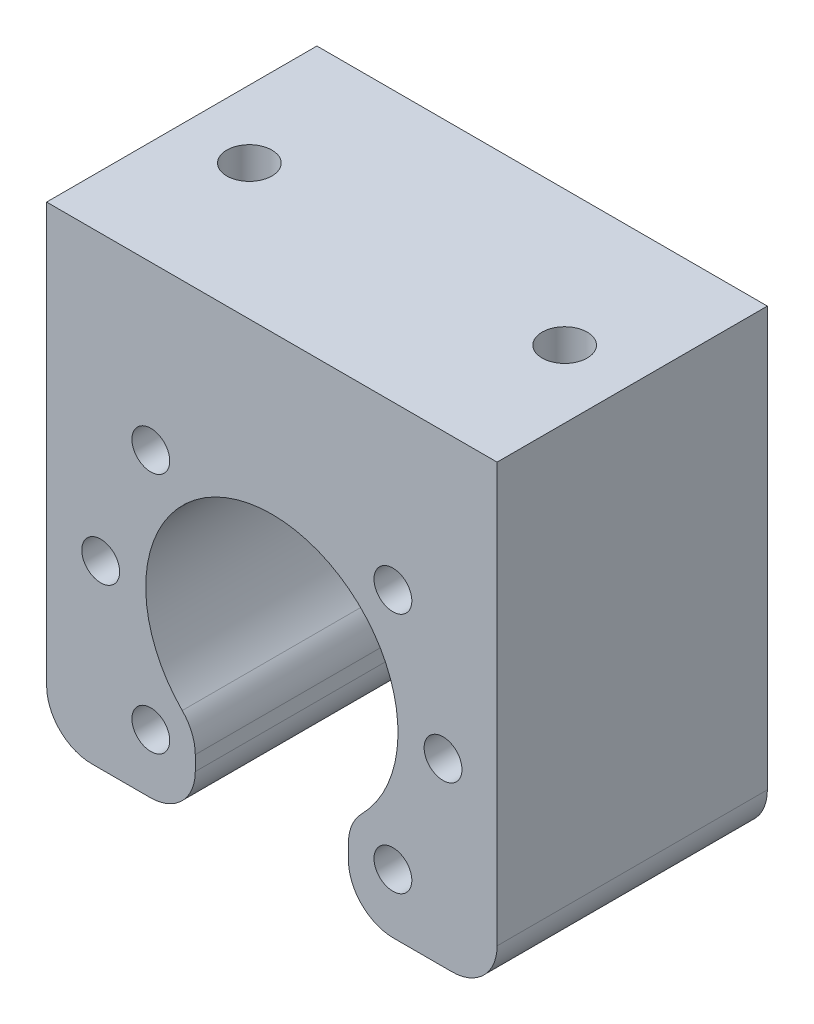
ISO-10303-21;
HEADER;
FILE_DESCRIPTION(('STEP AP214'),'2;1');
FILE_NAME('part.step','',(''),(''),'','','');
FILE_SCHEMA(('AUTOMOTIVE_DESIGN { 1 0 10303 214 1 1 1 1 }'));
ENDSEC;
DATA;
#1=APPLICATION_CONTEXT('core data for automotive mechanical design processes');
#2=APPLICATION_PROTOCOL_DEFINITION('international standard','automotive_design',2000,#1);
#3=PRODUCT_CONTEXT('',#1,'mechanical');
#4=PRODUCT('Part','Part','',(#3));
#5=PRODUCT_RELATED_PRODUCT_CATEGORY('part','',(#4));
#6=PRODUCT_DEFINITION_FORMATION('','',#4);
#7=PRODUCT_DEFINITION_CONTEXT('part definition',#1,'design');
#8=PRODUCT_DEFINITION('design','',#6,#7);
#9=PRODUCT_DEFINITION_SHAPE('','',#8);
#10=(LENGTH_UNIT() NAMED_UNIT(*) SI_UNIT(.MILLI.,.METRE.));
#11=(NAMED_UNIT(*) PLANE_ANGLE_UNIT() SI_UNIT($,.RADIAN.));
#12=(NAMED_UNIT(*) SI_UNIT($,.STERADIAN.) SOLID_ANGLE_UNIT());
#13=UNCERTAINTY_MEASURE_WITH_UNIT(LENGTH_MEASURE(1.E-05),#10,'distance_accuracy_value','');
#14=(GEOMETRIC_REPRESENTATION_CONTEXT(3) GLOBAL_UNCERTAINTY_ASSIGNED_CONTEXT((#13)) GLOBAL_UNIT_ASSIGNED_CONTEXT((#10,
#11,#12)) REPRESENTATION_CONTEXT('',''));
#15=CARTESIAN_POINT('',(0.,0.,0.));
#16=DIRECTION('',(0.,0.,1.));
#17=DIRECTION('',(1.,0.,0.));
#18=AXIS2_PLACEMENT_3D('',#15,#16,#17);
#19=CARTESIAN_POINT('',(-8.5,-11.1242977306435,30.));
#20=DIRECTION('',(-1.,0.,0.));
#21=DIRECTION('',(0.,-1.,0.));
#22=AXIS2_PLACEMENT_3D('',#19,#20,#21);
#23=PLANE('',#22);
#24=DIRECTION('',(0.,1.,0.));
#25=VECTOR('',#24,1.);
#26=CARTESIAN_POINT('',(-8.5,-11.1242977306435,30.));
#27=LINE('',#26,#25);
#28=CARTESIAN_POINT('',(-8.5,-15.,30.));
#29=VERTEX_POINT('',#28);
#30=CARTESIAN_POINT('',(-8.5,-13.3697419571209,30.));
#31=VERTEX_POINT('',#30);
#32=EDGE_CURVE('E213',#29,#31,#27,.T.);
#33=ORIENTED_EDGE('',*,*,#32,.F.);
#34=DIRECTION('',(0.,0.,-1.));
#35=VECTOR('',#34,1.);
#36=CARTESIAN_POINT('',(-8.5,-15.,30.));
#37=LINE('',#36,#35);
#38=CARTESIAN_POINT('',(-8.5,-15.,0.));
#39=VERTEX_POINT('',#38);
#40=EDGE_CURVE('E299',#29,#39,#37,.T.);
#41=ORIENTED_EDGE('',*,*,#40,.T.);
#42=DIRECTION('',(0.,1.,0.));
#43=VECTOR('',#42,1.);
#44=CARTESIAN_POINT('',(-8.5,-11.1242977306435,0.));
#45=LINE('',#44,#43);
#46=CARTESIAN_POINT('',(-8.5,-13.3697419571209,0.));
#47=VERTEX_POINT('',#46);
#48=EDGE_CURVE('E212',#39,#47,#45,.T.);
#49=ORIENTED_EDGE('',*,*,#48,.T.);
#50=DIRECTION('',(0.,0.,-1.));
#51=VECTOR('',#50,1.);
#52=CARTESIAN_POINT('',(-8.5,-13.3697419571209,30.));
#53=LINE('',#52,#51);
#54=EDGE_CURVE('E297',#47,#31,#53,.F.);
#55=ORIENTED_EDGE('',*,*,#54,.T.);
#56=EDGE_LOOP('',(#33,#41,#49,#55));
#57=FACE_BOUND('',#56,.T.);
#58=ADVANCED_FACE('F41',(#57),#23,.F.);
#59=CARTESIAN_POINT('',(0.,0.,30.));
#60=DIRECTION('',(0.,0.,-1.));
#61=DIRECTION('',(-1.,0.,0.));
#62=AXIS2_PLACEMENT_3D('',#59,#60,#61);
#63=CYLINDRICAL_SURFACE('',#62,14.);
#64=CARTESIAN_POINT('',(0.,0.,0.));
#65=DIRECTION('',(0.,0.,-1.));
#66=DIRECTION('',(1.,0.,0.));
#67=AXIS2_PLACEMENT_3D('',#64,#65,#66);
#68=CIRCLE('',#67,14.);
#69=CARTESIAN_POINT('',(-9.94736842105263,-9.85138881051016,0.));
#70=VERTEX_POINT('',#69);
#71=CARTESIAN_POINT('',(9.94736842105263,-9.85138881051016,0.));
#72=VERTEX_POINT('',#71);
#73=EDGE_CURVE('E238',#70,#72,#68,.T.);
#74=ORIENTED_EDGE('',*,*,#73,.T.);
#75=DIRECTION('',(0.,0.,-1.));
#76=VECTOR('',#75,1.);
#77=CARTESIAN_POINT('',(9.94736842105263,-9.85138881051016,30.));
#78=LINE('',#77,#76);
#79=CARTESIAN_POINT('',(9.94736842105263,-9.85138881051016,30.));
#80=VERTEX_POINT('',#79);
#81=EDGE_CURVE('E11',#72,#80,#78,.F.);
#82=ORIENTED_EDGE('',*,*,#81,.T.);
#83=CARTESIAN_POINT('',(0.,0.,30.));
#84=DIRECTION('',(0.,0.,-1.));
#85=DIRECTION('',(1.,0.,0.));
#86=AXIS2_PLACEMENT_3D('',#83,#84,#85);
#87=CIRCLE('',#86,14.);
#88=CARTESIAN_POINT('',(-9.94736842105263,-9.85138881051016,30.));
#89=VERTEX_POINT('',#88);
#90=EDGE_CURVE('E216',#89,#80,#87,.T.);
#91=ORIENTED_EDGE('',*,*,#90,.F.);
#92=DIRECTION('',(0.,0.,-1.));
#93=VECTOR('',#92,1.);
#94=CARTESIAN_POINT('',(-9.94736842105263,-9.85138881051016,30.));
#95=LINE('',#94,#93);
#96=EDGE_CURVE('E55',#89,#70,#95,.T.);
#97=ORIENTED_EDGE('',*,*,#96,.T.);
#98=EDGE_LOOP('',(#74,#82,#91,#97));
#99=FACE_BOUND('',#98,.T.);
#100=ADVANCED_FACE('F330',(#99),#63,.F.);
#101=CARTESIAN_POINT('',(8.5,-11.1242977306435,30.));
#102=DIRECTION('',(1.,0.,0.));
#103=DIRECTION('',(0.,1.,0.));
#104=AXIS2_PLACEMENT_3D('',#101,#102,#103);
#105=PLANE('',#104);
#106=DIRECTION('',(0.,-1.,0.));
#107=VECTOR('',#106,1.);
#108=CARTESIAN_POINT('',(8.5,-11.1242977306435,0.));
#109=LINE('',#108,#107);
#110=CARTESIAN_POINT('',(8.5,-13.3697419571209,0.));
#111=VERTEX_POINT('',#110);
#112=CARTESIAN_POINT('',(8.5,-15.,0.));
#113=VERTEX_POINT('',#112);
#114=EDGE_CURVE('E241',#111,#113,#109,.T.);
#115=ORIENTED_EDGE('',*,*,#114,.T.);
#116=DIRECTION('',(0.,0.,-1.));
#117=VECTOR('',#116,1.);
#118=CARTESIAN_POINT('',(8.5,-15.,30.));
#119=LINE('',#118,#117);
#120=CARTESIAN_POINT('',(8.5,-15.,30.));
#121=VERTEX_POINT('',#120);
#122=EDGE_CURVE('E305',#113,#121,#119,.F.);
#123=ORIENTED_EDGE('',*,*,#122,.T.);
#124=DIRECTION('',(0.,-1.,0.));
#125=VECTOR('',#124,1.);
#126=CARTESIAN_POINT('',(8.5,-11.1242977306435,30.));
#127=LINE('',#126,#125);
#128=CARTESIAN_POINT('',(8.5,-13.3697419571209,30.));
#129=VERTEX_POINT('',#128);
#130=EDGE_CURVE('E220',#129,#121,#127,.T.);
#131=ORIENTED_EDGE('',*,*,#130,.F.);
#132=DIRECTION('',(0.,0.,-1.));
#133=VECTOR('',#132,1.);
#134=CARTESIAN_POINT('',(8.5,-13.3697419571209,30.));
#135=LINE('',#134,#133);
#136=EDGE_CURVE('E302',#129,#111,#135,.T.);
#137=ORIENTED_EDGE('',*,*,#136,.T.);
#138=EDGE_LOOP('',(#115,#123,#131,#137));
#139=FACE_BOUND('',#138,.T.);
#140=ADVANCED_FACE('F336',(#139),#105,.F.);
#141=CARTESIAN_POINT('',(8.5,-20.,30.));
#142=DIRECTION('',(0.,1.,0.));
#143=DIRECTION('',(-1.,0.,0.));
#144=AXIS2_PLACEMENT_3D('',#141,#142,#143);
#145=PLANE('',#144);
#146=DIRECTION('',(1.,0.,0.));
#147=VECTOR('',#146,1.);
#148=CARTESIAN_POINT('',(8.5,-20.,0.));
#149=LINE('',#148,#147);
#150=CARTESIAN_POINT('',(13.5,-20.,0.));
#151=VERTEX_POINT('',#150);
#152=CARTESIAN_POINT('',(20.,-20.,0.));
#153=VERTEX_POINT('',#152);
#154=EDGE_CURVE('E244',#151,#153,#149,.T.);
#155=ORIENTED_EDGE('',*,*,#154,.T.);
#156=DIRECTION('',(0.,0.,-1.));
#157=VECTOR('',#156,1.);
#158=CARTESIAN_POINT('',(20.,-20.,30.));
#159=LINE('',#158,#157);
#160=CARTESIAN_POINT('',(20.,-20.,30.));
#161=VERTEX_POINT('',#160);
#162=EDGE_CURVE('E71',#153,#161,#159,.F.);
#163=ORIENTED_EDGE('',*,*,#162,.T.);
#164=DIRECTION('',(1.,0.,0.));
#165=VECTOR('',#164,1.);
#166=CARTESIAN_POINT('',(8.5,-20.,30.));
#167=LINE('',#166,#165);
#168=CARTESIAN_POINT('',(13.5,-20.,30.));
#169=VERTEX_POINT('',#168);
#170=EDGE_CURVE('E223',#169,#161,#167,.T.);
#171=ORIENTED_EDGE('',*,*,#170,.F.);
#172=DIRECTION('',(0.,0.,-1.));
#173=VECTOR('',#172,1.);
#174=CARTESIAN_POINT('',(13.5,-20.,30.));
#175=LINE('',#174,#173);
#176=EDGE_CURVE('E293',#169,#151,#175,.T.);
#177=ORIENTED_EDGE('',*,*,#176,.T.);
#178=EDGE_LOOP('',(#155,#163,#171,#177));
#179=FACE_BOUND('',#178,.T.);
#180=ADVANCED_FACE('F377',(#179),#145,.F.);
#181=CARTESIAN_POINT('',(25.,31.5,30.));
#182=DIRECTION('',(-1.,0.,0.));
#183=DIRECTION('',(0.,-1.,0.));
#184=AXIS2_PLACEMENT_3D('',#181,#182,#183);
#185=PLANE('',#184);
#186=DIRECTION('',(0.,1.,0.));
#187=VECTOR('',#186,1.);
#188=CARTESIAN_POINT('',(25.,31.5,30.));
#189=LINE('',#188,#187);
#190=CARTESIAN_POINT('',(25.,-15.,30.));
#191=VERTEX_POINT('',#190);
#192=CARTESIAN_POINT('',(25.,31.5,30.));
#193=VERTEX_POINT('',#192);
#194=EDGE_CURVE('E225',#191,#193,#189,.T.);
#195=ORIENTED_EDGE('',*,*,#194,.F.);
#196=DIRECTION('',(0.,0.,-1.));
#197=VECTOR('',#196,1.);
#198=CARTESIAN_POINT('',(25.,-15.,30.));
#199=LINE('',#198,#197);
#200=CARTESIAN_POINT('',(25.,-15.,0.));
#201=VERTEX_POINT('',#200);
#202=EDGE_CURVE('E290',#191,#201,#199,.T.);
#203=ORIENTED_EDGE('',*,*,#202,.T.);
#204=DIRECTION('',(0.,1.,0.));
#205=VECTOR('',#204,1.);
#206=CARTESIAN_POINT('',(25.,31.5,0.));
#207=LINE('',#206,#205);
#208=CARTESIAN_POINT('',(25.,31.5,0.));
#209=VERTEX_POINT('',#208);
#210=EDGE_CURVE('E246',#201,#209,#207,.T.);
#211=ORIENTED_EDGE('',*,*,#210,.T.);
#212=DIRECTION('',(0.,0.,-1.));
#213=VECTOR('',#212,1.);
#214=CARTESIAN_POINT('',(25.,31.5,30.));
#215=LINE('',#214,#213);
#216=EDGE_CURVE('E257',#193,#209,#215,.T.);
#217=ORIENTED_EDGE('',*,*,#216,.F.);
#218=EDGE_LOOP('',(#195,#203,#211,#217));
#219=FACE_BOUND('',#218,.T.);
#220=ADVANCED_FACE('F385',(#219),#185,.F.);
#221=CARTESIAN_POINT('',(-25.,31.5,30.));
#222=DIRECTION('',(0.,-1.,0.));
#223=DIRECTION('',(0.,0.,-1.));
#224=AXIS2_PLACEMENT_3D('',#221,#222,#223);
#225=PLANE('',#224);
#226=CARTESIAN_POINT('',(-17.4999999999991,31.5,14.9999999999994));
#227=DIRECTION('',(0.,1.,0.));
#228=DIRECTION('',(0.,0.,1.));
#229=AXIS2_PLACEMENT_3D('',#226,#227,#228);
#230=CIRCLE('',#229,2.49999999999999);
#231=CARTESIAN_POINT('',(-17.4999999999991,31.5,17.4999999999994));
#232=VERTEX_POINT('',#231);
#233=EDGE_CURVE('E163',#232,#232,#230,.T.);
#234=ORIENTED_EDGE('',*,*,#233,.F.);
#235=EDGE_LOOP('',(#234));
#236=FACE_BOUND('',#235,.T.);
#237=CARTESIAN_POINT('',(17.5000000000009,31.5,14.9999999999995));
#238=DIRECTION('',(0.,1.,0.));
#239=DIRECTION('',(0.,0.,1.));
#240=AXIS2_PLACEMENT_3D('',#237,#238,#239);
#241=CIRCLE('',#240,2.49999999999999);
#242=CARTESIAN_POINT('',(17.5000000000009,31.5,17.4999999999995));
#243=VERTEX_POINT('',#242);
#244=EDGE_CURVE('E166',#243,#243,#241,.T.);
#245=ORIENTED_EDGE('',*,*,#244,.F.);
#246=EDGE_LOOP('',(#245));
#247=FACE_BOUND('',#246,.T.);
#248=DIRECTION('',(-1.,0.,0.));
#249=VECTOR('',#248,1.);
#250=CARTESIAN_POINT('',(-25.,31.5,0.));
#251=LINE('',#250,#249);
#252=CARTESIAN_POINT('',(-25.,31.5,0.));
#253=VERTEX_POINT('',#252);
#254=EDGE_CURVE('E248',#209,#253,#251,.T.);
#255=ORIENTED_EDGE('',*,*,#254,.T.);
#256=DIRECTION('',(0.,0.,-1.));
#257=VECTOR('',#256,1.);
#258=CARTESIAN_POINT('',(-25.,31.5,30.));
#259=LINE('',#258,#257);
#260=CARTESIAN_POINT('',(-25.,31.5,30.));
#261=VERTEX_POINT('',#260);
#262=EDGE_CURVE('E235',#261,#253,#259,.T.);
#263=ORIENTED_EDGE('',*,*,#262,.F.);
#264=DIRECTION('',(-1.,0.,0.));
#265=VECTOR('',#264,1.);
#266=CARTESIAN_POINT('',(-25.,31.5,30.));
#267=LINE('',#266,#265);
#268=EDGE_CURVE('E227',#193,#261,#267,.T.);
#269=ORIENTED_EDGE('',*,*,#268,.F.);
#270=ORIENTED_EDGE('',*,*,#216,.T.);
#271=EDGE_LOOP('',(#255,#263,#269,#270));
#272=FACE_BOUND('',#271,.T.);
#273=ADVANCED_FACE('F392',(#236,#247,#272),#225,.F.);
#274=CARTESIAN_POINT('',(-25.,31.5,30.));
#275=DIRECTION('',(1.,0.,0.));
#276=DIRECTION('',(0.,1.,0.));
#277=AXIS2_PLACEMENT_3D('',#274,#275,#276);
#278=PLANE('',#277);
#279=DIRECTION('',(0.,-1.,0.));
#280=VECTOR('',#279,1.);
#281=CARTESIAN_POINT('',(-25.,31.5,0.));
#282=LINE('',#281,#280);
#283=CARTESIAN_POINT('',(-25.,-15.,0.));
#284=VERTEX_POINT('',#283);
#285=EDGE_CURVE('E250',#253,#284,#282,.T.);
#286=ORIENTED_EDGE('',*,*,#285,.T.);
#287=DIRECTION('',(0.,0.,-1.));
#288=VECTOR('',#287,1.);
#289=CARTESIAN_POINT('',(-25.,-15.,30.));
#290=LINE('',#289,#288);
#291=CARTESIAN_POINT('',(-25.,-15.,30.));
#292=VERTEX_POINT('',#291);
#293=EDGE_CURVE('E277',#284,#292,#290,.F.);
#294=ORIENTED_EDGE('',*,*,#293,.T.);
#295=DIRECTION('',(0.,-1.,0.));
#296=VECTOR('',#295,1.);
#297=CARTESIAN_POINT('',(-25.,31.5,30.));
#298=LINE('',#297,#296);
#299=EDGE_CURVE('E229',#261,#292,#298,.T.);
#300=ORIENTED_EDGE('',*,*,#299,.F.);
#301=ORIENTED_EDGE('',*,*,#262,.T.);
#302=EDGE_LOOP('',(#286,#294,#300,#301));
#303=FACE_BOUND('',#302,.T.);
#304=ADVANCED_FACE('F395',(#303),#278,.F.);
#305=CARTESIAN_POINT('',(-25.,-20.,30.));
#306=DIRECTION('',(0.,1.,0.));
#307=DIRECTION('',(-1.,0.,0.));
#308=AXIS2_PLACEMENT_3D('',#305,#306,#307);
#309=PLANE('',#308);
#310=DIRECTION('',(1.,0.,0.));
#311=VECTOR('',#310,1.);
#312=CARTESIAN_POINT('',(-25.,-20.,30.));
#313=LINE('',#312,#311);
#314=CARTESIAN_POINT('',(-20.,-20.,30.));
#315=VERTEX_POINT('',#314);
#316=CARTESIAN_POINT('',(-13.5,-20.,30.));
#317=VERTEX_POINT('',#316);
#318=EDGE_CURVE('E232',#315,#317,#313,.T.);
#319=ORIENTED_EDGE('',*,*,#318,.F.);
#320=DIRECTION('',(0.,0.,-1.));
#321=VECTOR('',#320,1.);
#322=CARTESIAN_POINT('',(-20.,-20.,30.));
#323=LINE('',#322,#321);
#324=CARTESIAN_POINT('',(-20.,-20.,0.));
#325=VERTEX_POINT('',#324);
#326=EDGE_CURVE('E262',#315,#325,#323,.T.);
#327=ORIENTED_EDGE('',*,*,#326,.T.);
#328=DIRECTION('',(1.,0.,0.));
#329=VECTOR('',#328,1.);
#330=CARTESIAN_POINT('',(-25.,-20.,0.));
#331=LINE('',#330,#329);
#332=CARTESIAN_POINT('',(-13.5,-20.,0.));
#333=VERTEX_POINT('',#332);
#334=EDGE_CURVE('E217',#325,#333,#331,.T.);
#335=ORIENTED_EDGE('',*,*,#334,.T.);
#336=DIRECTION('',(0.,0.,-1.));
#337=VECTOR('',#336,1.);
#338=CARTESIAN_POINT('',(-13.5,-20.,30.));
#339=LINE('',#338,#337);
#340=EDGE_CURVE('E260',#333,#317,#339,.F.);
#341=ORIENTED_EDGE('',*,*,#340,.T.);
#342=EDGE_LOOP('',(#319,#327,#335,#341));
#343=FACE_BOUND('',#342,.T.);
#344=ADVANCED_FACE('F401',(#343),#309,.F.);
#345=CARTESIAN_POINT('',(0.,0.,30.));
#346=DIRECTION('',(0.,0.,1.));
#347=DIRECTION('',(1.,0.,0.));
#348=AXIS2_PLACEMENT_3D('',#345,#346,#347);
#349=PLANE('',#348);
#350=CARTESIAN_POINT('',(13.4350288425458,13.4350288425462,30.));
#351=DIRECTION('',(0.,0.,-1.));
#352=DIRECTION('',(-1.,0.,0.));
#353=AXIS2_PLACEMENT_3D('',#350,#351,#352);
#354=CIRCLE('',#353,2.09999999999999);
#355=CARTESIAN_POINT('',(11.3350288425458,13.4350288425462,30.));
#356=VERTEX_POINT('',#355);
#357=EDGE_CURVE('E179',#356,#356,#354,.T.);
#358=ORIENTED_EDGE('',*,*,#357,.T.);
#359=EDGE_LOOP('',(#358));
#360=FACE_BOUND('',#359,.T.);
#361=CARTESIAN_POINT('',(-13.4350288425429,13.4350288425463,30.));
#362=DIRECTION('',(0.,0.,-1.));
#363=DIRECTION('',(-1.,0.,0.));
#364=AXIS2_PLACEMENT_3D('',#361,#362,#363);
#365=CIRCLE('',#364,2.09999999999999);
#366=CARTESIAN_POINT('',(-15.5350288425429,13.4350288425463,30.));
#367=VERTEX_POINT('',#366);
#368=EDGE_CURVE('E185',#367,#367,#365,.T.);
#369=ORIENTED_EDGE('',*,*,#368,.T.);
#370=EDGE_LOOP('',(#369));
#371=FACE_BOUND('',#370,.T.);
#372=CARTESIAN_POINT('',(-18.9999999999986,1.84111669868261E-12,30.));
#373=DIRECTION('',(0.,0.,-1.));
#374=DIRECTION('',(-1.,0.,0.));
#375=AXIS2_PLACEMENT_3D('',#372,#373,#374);
#376=CIRCLE('',#375,2.09999999999999);
#377=CARTESIAN_POINT('',(-21.0999999999986,1.84111669868261E-12,30.));
#378=VERTEX_POINT('',#377);
#379=EDGE_CURVE('E191',#378,#378,#376,.T.);
#380=ORIENTED_EDGE('',*,*,#379,.T.);
#381=EDGE_LOOP('',(#380));
#382=FACE_BOUND('',#381,.T.);
#383=CARTESIAN_POINT('',(-13.435028842543,-13.4350288425426,30.));
#384=DIRECTION('',(0.,0.,-1.));
#385=DIRECTION('',(-1.,0.,0.));
#386=AXIS2_PLACEMENT_3D('',#383,#384,#385);
#387=CIRCLE('',#386,2.09999999999999);
#388=CARTESIAN_POINT('',(-15.535028842543,-13.4350288425426,30.));
#389=VERTEX_POINT('',#388);
#390=EDGE_CURVE('E197',#389,#389,#387,.T.);
#391=ORIENTED_EDGE('',*,*,#390,.T.);
#392=EDGE_LOOP('',(#391));
#393=FACE_BOUND('',#392,.T.);
#394=CARTESIAN_POINT('',(13.4350288425457,-13.4350288425427,30.));
#395=DIRECTION('',(0.,0.,-1.));
#396=DIRECTION('',(-1.,0.,0.));
#397=AXIS2_PLACEMENT_3D('',#394,#395,#396);
#398=CIRCLE('',#397,2.09999999999999);
#399=CARTESIAN_POINT('',(11.3350288425457,-13.4350288425427,30.));
#400=VERTEX_POINT('',#399);
#401=EDGE_CURVE('E203',#400,#400,#398,.T.);
#402=ORIENTED_EDGE('',*,*,#401,.T.);
#403=EDGE_LOOP('',(#402));
#404=FACE_BOUND('',#403,.T.);
#405=CARTESIAN_POINT('',(19.0000000000014,1.7113408654584E-12,30.));
#406=DIRECTION('',(0.,0.,-1.));
#407=DIRECTION('',(-1.,0.,0.));
#408=AXIS2_PLACEMENT_3D('',#405,#406,#407);
#409=CIRCLE('',#408,2.09999999999999);
#410=CARTESIAN_POINT('',(16.9000000000014,1.7113408654584E-12,30.));
#411=VERTEX_POINT('',#410);
#412=EDGE_CURVE('E209',#411,#411,#409,.T.);
#413=ORIENTED_EDGE('',*,*,#412,.T.);
#414=EDGE_LOOP('',(#413));
#415=FACE_BOUND('',#414,.T.);
#416=ORIENTED_EDGE('',*,*,#299,.T.);
#417=CARTESIAN_POINT('',(-20.,-15.,30.));
#418=DIRECTION('',(0.,0.,1.));
#419=DIRECTION('',(1.,0.,0.));
#420=AXIS2_PLACEMENT_3D('',#417,#418,#419);
#421=CIRCLE('',#420,5.);
#422=EDGE_CURVE('E288',#292,#315,#421,.T.);
#423=ORIENTED_EDGE('',*,*,#422,.T.);
#424=ORIENTED_EDGE('',*,*,#318,.T.);
#425=CARTESIAN_POINT('',(-13.5,-15.,30.));
#426=DIRECTION('',(0.,0.,1.));
#427=DIRECTION('',(1.,0.,0.));
#428=AXIS2_PLACEMENT_3D('',#425,#426,#427);
#429=CIRCLE('',#428,5.);
#430=EDGE_CURVE('E285',#317,#29,#429,.T.);
#431=ORIENTED_EDGE('',*,*,#430,.T.);
#432=ORIENTED_EDGE('',*,*,#32,.T.);
#433=CARTESIAN_POINT('',(-13.5,-13.3697419571209,30.));
#434=DIRECTION('',(0.,0.,1.));
#435=DIRECTION('',(1.,0.,0.));
#436=AXIS2_PLACEMENT_3D('',#433,#434,#435);
#437=CIRCLE('',#436,5.);
#438=EDGE_CURVE('E279',#31,#89,#437,.T.);
#439=ORIENTED_EDGE('',*,*,#438,.T.);
#440=ORIENTED_EDGE('',*,*,#90,.T.);
#441=CARTESIAN_POINT('',(13.5,-13.3697419571209,30.));
#442=DIRECTION('',(0.,0.,1.));
#443=DIRECTION('',(1.,0.,0.));
#444=AXIS2_PLACEMENT_3D('',#441,#442,#443);
#445=CIRCLE('',#444,5.);
#446=EDGE_CURVE('E281',#80,#129,#445,.T.);
#447=ORIENTED_EDGE('',*,*,#446,.T.);
#448=ORIENTED_EDGE('',*,*,#130,.T.);
#449=CARTESIAN_POINT('',(13.5,-15.,30.));
#450=DIRECTION('',(0.,0.,1.));
#451=DIRECTION('',(1.,0.,0.));
#452=AXIS2_PLACEMENT_3D('',#449,#450,#451);
#453=CIRCLE('',#452,5.);
#454=EDGE_CURVE('E283',#121,#169,#453,.T.);
#455=ORIENTED_EDGE('',*,*,#454,.T.);
#456=ORIENTED_EDGE('',*,*,#170,.T.);
#457=CARTESIAN_POINT('',(20.,-15.,30.));
#458=DIRECTION('',(0.,0.,1.));
#459=DIRECTION('',(1.,0.,0.));
#460=AXIS2_PLACEMENT_3D('',#457,#458,#459);
#461=CIRCLE('',#460,5.);
#462=EDGE_CURVE('E63',#161,#191,#461,.T.);
#463=ORIENTED_EDGE('',*,*,#462,.T.);
#464=ORIENTED_EDGE('',*,*,#194,.T.);
#465=ORIENTED_EDGE('',*,*,#268,.T.);
#466=EDGE_LOOP('',(#416,#423,#424,#431,#432,#439,#440,#447,#448,#455,#456,#463,#464,#465));
#467=FACE_BOUND('',#466,.T.);
#468=ADVANCED_FACE('F370',(#360,#371,#382,#393,#404,#415,#467),#349,.T.);
#469=CARTESIAN_POINT('',(0.,0.,0.));
#470=DIRECTION('',(0.,0.,1.));
#471=DIRECTION('',(1.,0.,0.));
#472=AXIS2_PLACEMENT_3D('',#469,#470,#471);
#473=PLANE('',#472);
#474=CARTESIAN_POINT('',(13.4350288425458,13.4350288425462,0.));
#475=DIRECTION('',(0.,0.,-1.));
#476=DIRECTION('',(-1.,0.,0.));
#477=AXIS2_PLACEMENT_3D('',#474,#475,#476);
#478=CIRCLE('',#477,2.1);
#479=CARTESIAN_POINT('',(11.3350288425458,13.4350288425462,0.));
#480=VERTEX_POINT('',#479);
#481=EDGE_CURVE('E176',#480,#480,#478,.T.);
#482=ORIENTED_EDGE('',*,*,#481,.F.);
#483=EDGE_LOOP('',(#482));
#484=FACE_BOUND('',#483,.T.);
#485=CARTESIAN_POINT('',(-13.4350288425429,13.4350288425463,0.));
#486=DIRECTION('',(0.,0.,-1.));
#487=DIRECTION('',(-1.,0.,0.));
#488=AXIS2_PLACEMENT_3D('',#485,#486,#487);
#489=CIRCLE('',#488,2.1);
#490=CARTESIAN_POINT('',(-15.5350288425429,13.4350288425463,0.));
#491=VERTEX_POINT('',#490);
#492=EDGE_CURVE('E182',#491,#491,#489,.T.);
#493=ORIENTED_EDGE('',*,*,#492,.F.);
#494=EDGE_LOOP('',(#493));
#495=FACE_BOUND('',#494,.T.);
#496=CARTESIAN_POINT('',(-18.9999999999986,1.84111669868261E-12,0.));
#497=DIRECTION('',(0.,0.,-1.));
#498=DIRECTION('',(-1.,0.,0.));
#499=AXIS2_PLACEMENT_3D('',#496,#497,#498);
#500=CIRCLE('',#499,2.1);
#501=CARTESIAN_POINT('',(-21.0999999999986,1.84111669868261E-12,0.));
#502=VERTEX_POINT('',#501);
#503=EDGE_CURVE('E188',#502,#502,#500,.T.);
#504=ORIENTED_EDGE('',*,*,#503,.F.);
#505=EDGE_LOOP('',(#504));
#506=FACE_BOUND('',#505,.T.);
#507=CARTESIAN_POINT('',(-13.435028842543,-13.4350288425426,0.));
#508=DIRECTION('',(0.,0.,-1.));
#509=DIRECTION('',(-1.,0.,0.));
#510=AXIS2_PLACEMENT_3D('',#507,#508,#509);
#511=CIRCLE('',#510,2.1);
#512=CARTESIAN_POINT('',(-15.535028842543,-13.4350288425426,0.));
#513=VERTEX_POINT('',#512);
#514=EDGE_CURVE('E194',#513,#513,#511,.T.);
#515=ORIENTED_EDGE('',*,*,#514,.F.);
#516=EDGE_LOOP('',(#515));
#517=FACE_BOUND('',#516,.T.);
#518=CARTESIAN_POINT('',(13.4350288425457,-13.4350288425427,0.));
#519=DIRECTION('',(0.,0.,-1.));
#520=DIRECTION('',(-1.,0.,0.));
#521=AXIS2_PLACEMENT_3D('',#518,#519,#520);
#522=CIRCLE('',#521,2.1);
#523=CARTESIAN_POINT('',(11.3350288425457,-13.4350288425427,0.));
#524=VERTEX_POINT('',#523);
#525=EDGE_CURVE('E200',#524,#524,#522,.T.);
#526=ORIENTED_EDGE('',*,*,#525,.F.);
#527=EDGE_LOOP('',(#526));
#528=FACE_BOUND('',#527,.T.);
#529=CARTESIAN_POINT('',(19.0000000000014,1.7113408654584E-12,0.));
#530=DIRECTION('',(0.,0.,-1.));
#531=DIRECTION('',(-1.,0.,0.));
#532=AXIS2_PLACEMENT_3D('',#529,#530,#531);
#533=CIRCLE('',#532,2.1);
#534=CARTESIAN_POINT('',(16.9000000000014,1.7113408654584E-12,0.));
#535=VERTEX_POINT('',#534);
#536=EDGE_CURVE('E206',#535,#535,#533,.T.);
#537=ORIENTED_EDGE('',*,*,#536,.F.);
#538=EDGE_LOOP('',(#537));
#539=FACE_BOUND('',#538,.T.);
#540=ORIENTED_EDGE('',*,*,#334,.F.);
#541=CARTESIAN_POINT('',(-20.,-15.,0.));
#542=DIRECTION('',(0.,0.,1.));
#543=DIRECTION('',(1.,0.,0.));
#544=AXIS2_PLACEMENT_3D('',#541,#542,#543);
#545=CIRCLE('',#544,5.);
#546=EDGE_CURVE('E275',#325,#284,#545,.F.);
#547=ORIENTED_EDGE('',*,*,#546,.T.);
#548=ORIENTED_EDGE('',*,*,#285,.F.);
#549=ORIENTED_EDGE('',*,*,#254,.F.);
#550=ORIENTED_EDGE('',*,*,#210,.F.);
#551=CARTESIAN_POINT('',(20.,-15.,0.));
#552=DIRECTION('',(0.,0.,1.));
#553=DIRECTION('',(1.,0.,0.));
#554=AXIS2_PLACEMENT_3D('',#551,#552,#553);
#555=CIRCLE('',#554,5.);
#556=EDGE_CURVE('E273',#201,#153,#555,.F.);
#557=ORIENTED_EDGE('',*,*,#556,.T.);
#558=ORIENTED_EDGE('',*,*,#154,.F.);
#559=CARTESIAN_POINT('',(13.5,-15.,0.));
#560=DIRECTION('',(0.,0.,1.));
#561=DIRECTION('',(1.,0.,0.));
#562=AXIS2_PLACEMENT_3D('',#559,#560,#561);
#563=CIRCLE('',#562,5.);
#564=EDGE_CURVE('E269',#151,#113,#563,.F.);
#565=ORIENTED_EDGE('',*,*,#564,.T.);
#566=ORIENTED_EDGE('',*,*,#114,.F.);
#567=CARTESIAN_POINT('',(13.5,-13.3697419571209,0.));
#568=DIRECTION('',(0.,0.,1.));
#569=DIRECTION('',(1.,0.,0.));
#570=AXIS2_PLACEMENT_3D('',#567,#568,#569);
#571=CIRCLE('',#570,5.);
#572=EDGE_CURVE('E267',#111,#72,#571,.F.);
#573=ORIENTED_EDGE('',*,*,#572,.T.);
#574=ORIENTED_EDGE('',*,*,#73,.F.);
#575=CARTESIAN_POINT('',(-13.5,-13.3697419571209,0.));
#576=DIRECTION('',(0.,0.,1.));
#577=DIRECTION('',(1.,0.,0.));
#578=AXIS2_PLACEMENT_3D('',#575,#576,#577);
#579=CIRCLE('',#578,5.);
#580=EDGE_CURVE('E265',#70,#47,#579,.F.);
#581=ORIENTED_EDGE('',*,*,#580,.T.);
#582=ORIENTED_EDGE('',*,*,#48,.F.);
#583=CARTESIAN_POINT('',(-13.5,-15.,0.));
#584=DIRECTION('',(0.,0.,1.));
#585=DIRECTION('',(1.,0.,0.));
#586=AXIS2_PLACEMENT_3D('',#583,#584,#585);
#587=CIRCLE('',#586,5.);
#588=EDGE_CURVE('E271',#39,#333,#587,.F.);
#589=ORIENTED_EDGE('',*,*,#588,.T.);
#590=EDGE_LOOP('',(#540,#547,#548,#549,#550,#557,#558,#565,#566,#573,#574,#581,#582,#589));
#591=FACE_BOUND('',#590,.T.);
#592=ADVANCED_FACE('F346',(#484,#495,#506,#517,#528,#539,#591),#473,.F.);
#593=CARTESIAN_POINT('',(-20.,-15.,30.));
#594=DIRECTION('',(0.,0.,-1.));
#595=DIRECTION('',(-1.,0.,0.));
#596=AXIS2_PLACEMENT_3D('',#593,#594,#595);
#597=CYLINDRICAL_SURFACE('',#596,5.);
#598=ORIENTED_EDGE('',*,*,#422,.F.);
#599=ORIENTED_EDGE('',*,*,#293,.F.);
#600=ORIENTED_EDGE('',*,*,#546,.F.);
#601=ORIENTED_EDGE('',*,*,#326,.F.);
#602=EDGE_LOOP('',(#598,#599,#600,#601));
#603=FACE_BOUND('',#602,.T.);
#604=ADVANCED_FACE('F342',(#603),#597,.T.);
#605=CARTESIAN_POINT('',(20.,-15.,30.));
#606=DIRECTION('',(0.,0.,-1.));
#607=DIRECTION('',(-1.,0.,0.));
#608=AXIS2_PLACEMENT_3D('',#605,#606,#607);
#609=CYLINDRICAL_SURFACE('',#608,5.);
#610=ORIENTED_EDGE('',*,*,#462,.F.);
#611=ORIENTED_EDGE('',*,*,#162,.F.);
#612=ORIENTED_EDGE('',*,*,#556,.F.);
#613=ORIENTED_EDGE('',*,*,#202,.F.);
#614=EDGE_LOOP('',(#610,#611,#612,#613));
#615=FACE_BOUND('',#614,.T.);
#616=ADVANCED_FACE('F345',(#615),#609,.T.);
#617=CARTESIAN_POINT('',(-13.5,-15.,30.));
#618=DIRECTION('',(0.,0.,-1.));
#619=DIRECTION('',(-1.,0.,0.));
#620=AXIS2_PLACEMENT_3D('',#617,#618,#619);
#621=CYLINDRICAL_SURFACE('',#620,5.);
#622=ORIENTED_EDGE('',*,*,#430,.F.);
#623=ORIENTED_EDGE('',*,*,#340,.F.);
#624=ORIENTED_EDGE('',*,*,#588,.F.);
#625=ORIENTED_EDGE('',*,*,#40,.F.);
#626=EDGE_LOOP('',(#622,#623,#624,#625));
#627=FACE_BOUND('',#626,.T.);
#628=ADVANCED_FACE('F350',(#627),#621,.T.);
#629=CARTESIAN_POINT('',(13.5,-15.,30.));
#630=DIRECTION('',(0.,0.,-1.));
#631=DIRECTION('',(-1.,0.,0.));
#632=AXIS2_PLACEMENT_3D('',#629,#630,#631);
#633=CYLINDRICAL_SURFACE('',#632,5.);
#634=ORIENTED_EDGE('',*,*,#454,.F.);
#635=ORIENTED_EDGE('',*,*,#122,.F.);
#636=ORIENTED_EDGE('',*,*,#564,.F.);
#637=ORIENTED_EDGE('',*,*,#176,.F.);
#638=EDGE_LOOP('',(#634,#635,#636,#637));
#639=FACE_BOUND('',#638,.T.);
#640=ADVANCED_FACE('F354',(#639),#633,.T.);
#641=CARTESIAN_POINT('',(13.5,-13.3697419571209,30.));
#642=DIRECTION('',(0.,0.,-1.));
#643=DIRECTION('',(-1.,0.,0.));
#644=AXIS2_PLACEMENT_3D('',#641,#642,#643);
#645=CYLINDRICAL_SURFACE('',#644,5.);
#646=ORIENTED_EDGE('',*,*,#446,.F.);
#647=ORIENTED_EDGE('',*,*,#81,.F.);
#648=ORIENTED_EDGE('',*,*,#572,.F.);
#649=ORIENTED_EDGE('',*,*,#136,.F.);
#650=EDGE_LOOP('',(#646,#647,#648,#649));
#651=FACE_BOUND('',#650,.T.);
#652=ADVANCED_FACE('F357',(#651),#645,.T.);
#653=CARTESIAN_POINT('',(-13.5,-13.3697419571209,30.));
#654=DIRECTION('',(0.,0.,-1.));
#655=DIRECTION('',(-1.,0.,0.));
#656=AXIS2_PLACEMENT_3D('',#653,#654,#655);
#657=CYLINDRICAL_SURFACE('',#656,5.);
#658=ORIENTED_EDGE('',*,*,#438,.F.);
#659=ORIENTED_EDGE('',*,*,#54,.F.);
#660=ORIENTED_EDGE('',*,*,#580,.F.);
#661=ORIENTED_EDGE('',*,*,#96,.F.);
#662=EDGE_LOOP('',(#658,#659,#660,#661));
#663=FACE_BOUND('',#662,.T.);
#664=ADVANCED_FACE('F43',(#663),#657,.T.);
#665=CARTESIAN_POINT('',(19.0000000000014,1.7113408654584E-12,0.));
#666=DIRECTION('',(0.,0.,-1.));
#667=DIRECTION('',(-1.,0.,0.));
#668=AXIS2_PLACEMENT_3D('',#665,#666,#667);
#669=CYLINDRICAL_SURFACE('',#668,2.1);
#670=ORIENTED_EDGE('',*,*,#412,.F.);
#671=EDGE_LOOP('',(#670));
#672=FACE_BOUND('',#671,.T.);
#673=ORIENTED_EDGE('',*,*,#536,.T.);
#674=EDGE_LOOP('',(#673));
#675=FACE_BOUND('',#674,.T.);
#676=ADVANCED_FACE('F364',(#672,#675),#669,.F.);
#677=CARTESIAN_POINT('',(13.4350288425457,-13.4350288425427,0.));
#678=DIRECTION('',(0.,0.,-1.));
#679=DIRECTION('',(-1.,0.,0.));
#680=AXIS2_PLACEMENT_3D('',#677,#678,#679);
#681=CYLINDRICAL_SURFACE('',#680,2.1);
#682=ORIENTED_EDGE('',*,*,#401,.F.);
#683=EDGE_LOOP('',(#682));
#684=FACE_BOUND('',#683,.T.);
#685=ORIENTED_EDGE('',*,*,#525,.T.);
#686=EDGE_LOOP('',(#685));
#687=FACE_BOUND('',#686,.T.);
#688=ADVANCED_FACE('F514',(#684,#687),#681,.F.);
#689=CARTESIAN_POINT('',(-13.435028842543,-13.4350288425426,0.));
#690=DIRECTION('',(0.,0.,-1.));
#691=DIRECTION('',(-1.,0.,0.));
#692=AXIS2_PLACEMENT_3D('',#689,#690,#691);
#693=CYLINDRICAL_SURFACE('',#692,2.1);
#694=ORIENTED_EDGE('',*,*,#390,.F.);
#695=EDGE_LOOP('',(#694));
#696=FACE_BOUND('',#695,.T.);
#697=ORIENTED_EDGE('',*,*,#514,.T.);
#698=EDGE_LOOP('',(#697));
#699=FACE_BOUND('',#698,.T.);
#700=ADVANCED_FACE('F525',(#696,#699),#693,.F.);
#701=CARTESIAN_POINT('',(-18.9999999999986,1.84111669868261E-12,0.));
#702=DIRECTION('',(0.,0.,-1.));
#703=DIRECTION('',(-1.,0.,0.));
#704=AXIS2_PLACEMENT_3D('',#701,#702,#703);
#705=CYLINDRICAL_SURFACE('',#704,2.1);
#706=ORIENTED_EDGE('',*,*,#379,.F.);
#707=EDGE_LOOP('',(#706));
#708=FACE_BOUND('',#707,.T.);
#709=ORIENTED_EDGE('',*,*,#503,.T.);
#710=EDGE_LOOP('',(#709));
#711=FACE_BOUND('',#710,.T.);
#712=ADVANCED_FACE('F536',(#708,#711),#705,.F.);
#713=CARTESIAN_POINT('',(-13.4350288425429,13.4350288425463,0.));
#714=DIRECTION('',(0.,0.,-1.));
#715=DIRECTION('',(-1.,0.,0.));
#716=AXIS2_PLACEMENT_3D('',#713,#714,#715);
#717=CYLINDRICAL_SURFACE('',#716,2.1);
#718=CARTESIAN_POINT('',(-15.5350288425429,13.4350288425463,16.5456029083706));
#719=CARTESIAN_POINT('',(-15.5350211289829,13.5088402991268,16.5456007243016));
#720=CARTESIAN_POINT('',(-15.5311030470407,13.5827387728171,16.5406526632039));
#721=CARTESIAN_POINT('',(-15.5157179380661,13.7285086982992,16.5207809288947));
#722=CARTESIAN_POINT('',(-15.5042335637786,13.8003750953179,16.5058343308035));
#723=CARTESIAN_POINT('',(-15.4747057192673,13.9397929412851,16.4658774175586));
#724=CARTESIAN_POINT('',(-15.4566669041198,14.0073474127039,16.4408742434134));
#725=CARTESIAN_POINT('',(-15.41567308627,14.1361843969468,16.3809023024896));
#726=CARTESIAN_POINT('',(-15.3927217414591,14.1974715265567,16.3459409442477));
#727=CARTESIAN_POINT('',(-15.344404563906,14.3114213969755,16.2670857660948));
#728=CARTESIAN_POINT('',(-15.3190791422808,14.364197581287,16.2233306746445));
#729=CARTESIAN_POINT('',(-15.268014639986,14.4612737827105,16.1274689151349));
#730=CARTESIAN_POINT('',(-15.242275466059,14.5055718590234,16.0753603398103));
#731=CARTESIAN_POINT('',(-15.1916173518137,14.5868905797867,15.9619590061694));
#732=CARTESIAN_POINT('',(-15.1667667656512,14.6235706467379,15.9003924599852));
#733=CARTESIAN_POINT('',(-15.1209670810655,14.6876936395224,15.7712976146859));
#734=CARTESIAN_POINT('',(-15.100019624224,14.7151326826572,15.7037668246446));
#735=CARTESIAN_POINT('',(-15.0617733682493,14.7634662590936,15.5578977101825));
#736=CARTESIAN_POINT('',(-15.0449996973658,14.7835076887799,15.4791394578938));
#737=CARTESIAN_POINT('',(-15.0190425685753,14.8139044829089,15.3185580162725));
#738=CARTESIAN_POINT('',(-15.0098629418183,14.8242549586696,15.2367333016595));
#739=CARTESIAN_POINT('',(-14.9991839810832,14.8362773261249,15.0640133091675));
#740=CARTESIAN_POINT('',(-14.9985057137839,14.8370216335478,14.9730007631182));
#741=CARTESIAN_POINT('',(-15.0070202732263,14.8274659638124,14.7919900079227));
#742=CARTESIAN_POINT('',(-15.0162169089166,14.8171617250098,14.7019922037179));
#743=CARTESIAN_POINT('',(-15.0442124233567,14.7844759599291,14.5229932617078));
#744=CARTESIAN_POINT('',(-15.0632780013445,14.761757961048,14.4340939709091));
#745=CARTESIAN_POINT('',(-15.1094525574064,14.7029773363298,14.2630362124722));
#746=CARTESIAN_POINT('',(-15.1365568623472,14.6669224605843,14.1808738637886));
#747=CARTESIAN_POINT('',(-15.1939509253486,14.5833239545368,14.03142660184));
#748=CARTESIAN_POINT('',(-15.2239223990638,14.5366714957981,13.9635238702528));
#749=CARTESIAN_POINT('',(-15.2849133637509,14.4308356275271,13.8388765787188));
#750=CARTESIAN_POINT('',(-15.3159318779604,14.3716636397365,13.7821219386088));
#751=CARTESIAN_POINT('',(-15.3718752986861,14.2490652598762,13.687062236283));
#752=CARTESIAN_POINT('',(-15.3970958268272,14.1868069157965,13.6474200134327));
#753=CARTESIAN_POINT('',(-15.442660016778,14.0549273103147,13.5790680329954));
#754=CARTESIAN_POINT('',(-15.4630044173129,13.9853071665194,13.5503566190205));
#755=CARTESIAN_POINT('',(-15.4957795614943,13.8451334387696,13.5053989306839));
#756=CARTESIAN_POINT('',(-15.5086035072441,13.7748725165094,13.488521906031));
#757=CARTESIAN_POINT('',(-15.5270350052326,13.6317821967281,13.4645389743468));
#758=CARTESIAN_POINT('',(-15.5326427220918,13.558952857838,13.4574328444162));
#759=CARTESIAN_POINT('',(-15.536176319166,13.4131006469521,13.4529367134709));
#760=CARTESIAN_POINT('',(-15.5341324449741,13.3400796747084,13.4555084574801));
#761=CARTESIAN_POINT('',(-15.5225954254717,13.1956237683583,13.4703079248456));
#762=CARTESIAN_POINT('',(-15.5131027194996,13.1241887409672,13.4825350787181));
#763=CARTESIAN_POINT('',(-15.4874330315071,12.9848492636236,13.5167507208906));
#764=CARTESIAN_POINT('',(-15.4712477509417,12.9169493151421,13.538751330441));
#765=CARTESIAN_POINT('',(-15.4335990862969,12.7867137123754,13.5924997129669));
#766=CARTESIAN_POINT('',(-15.4121366506028,12.7243770610215,13.6242457347976));
#767=CARTESIAN_POINT('',(-15.3659260948417,12.6070135237137,13.697089324243));
#768=CARTESIAN_POINT('',(-15.3411853391313,12.551970791446,13.7381660750307));
#769=CARTESIAN_POINT('',(-15.2906237221949,12.4501397357152,13.82895334383));
#770=CARTESIAN_POINT('',(-15.2648027515372,12.4033522510714,13.8786647381942));
#771=CARTESIAN_POINT('',(-15.2135580348055,12.3172517026009,13.9871418400898));
#772=CARTESIAN_POINT('',(-15.1881692394145,12.2782038966718,14.0461337960847));
#773=CARTESIAN_POINT('',(-15.1407005066892,12.2092881236477,14.1704587474741));
#774=CARTESIAN_POINT('',(-15.1186219242268,12.1794239101736,14.2357943213858));
#775=CARTESIAN_POINT('',(-15.0776410961341,12.126190932334,14.377069081426));
#776=CARTESIAN_POINT('',(-15.0591842063012,12.1036164819519,14.4534360450102));
#777=CARTESIAN_POINT('',(-15.0293699747542,12.0680564446212,14.6097075199976));
#778=CARTESIAN_POINT('',(-15.0180161579833,12.0550756179878,14.6896137667636));
#779=CARTESIAN_POINT('',(-15.0023733040656,12.0373189448604,14.8592279394687));
#780=CARTESIAN_POINT('',(-14.9989092028229,12.0334990967409,14.949113694183));
#781=CARTESIAN_POINT('',(-15.0016944222767,12.0366153530939,15.1285773166237));
#782=CARTESIAN_POINT('',(-15.0079480254407,12.0435561996632,15.2181550311634));
#783=CARTESIAN_POINT('',(-15.0301935668008,12.0691032189925,15.39826505945));
#784=CARTESIAN_POINT('',(-15.0465768165374,12.0881790722034,15.4886841565223));
#785=CARTESIAN_POINT('',(-15.0880263861887,12.1393906623842,15.6636673601305));
#786=CARTESIAN_POINT('',(-15.1130893356074,12.1715213307536,15.7482337241243));
#787=CARTESIAN_POINT('',(-15.1678679471733,12.2478688115537,15.9042354899764));
#788=CARTESIAN_POINT('',(-15.1972765361739,12.2913758726481,15.9761234454451));
#789=CARTESIAN_POINT('',(-15.2582843498992,12.3914079725578,16.109079935246));
#790=CARTESIAN_POINT('',(-15.2898811393202,12.4479186969844,16.1701602367769));
#791=CARTESIAN_POINT('',(-15.347903162606,12.5662577662197,16.2734264175898));
#792=CARTESIAN_POINT('',(-15.3745164031485,12.626832099891,16.3169470362928));
#793=CARTESIAN_POINT('',(-15.4234803704345,12.7561833837402,16.3928811671285));
#794=CARTESIAN_POINT('',(-15.4458297023238,12.8249630061996,16.4252910473542));
#795=CARTESIAN_POINT('',(-15.4826003198902,12.9635966525438,16.4768327212876));
#796=CARTESIAN_POINT('',(-15.4974585847607,13.0330569802833,16.4967197673933));
#797=CARTESIAN_POINT('',(-15.520108646677,13.1750606259429,16.5265614303539));
#798=CARTESIAN_POINT('',(-15.5279171070136,13.2475962474053,16.5365394742649));
#799=CARTESIAN_POINT('',(-15.5339893404564,13.3586476096274,16.5442802965297));
#800=CARTESIAN_POINT('',(-15.5350328348163,13.3968265712694,16.5456040387695));
#801=CARTESIAN_POINT('',(-15.5350288425429,13.4350288425463,16.5456029083706));
#802=B_SPLINE_CURVE_WITH_KNOTS('',3,(#718,#719,#720,#721,#722,#723,#724,#725,#726,#727,#728,
#729,#730,#731,#732,#733,#734,#735,#736,#737,#738,#739,#740,#741,#742,#743,#744,#745,#746,#747,
#748,#749,#750,#751,#752,#753,#754,#755,#756,#757,#758,#759,#760,#761,#762,#763,#764,#765,#766,
#767,#768,#769,#770,#771,#772,#773,#774,#775,#776,#777,#778,#779,#780,#781,#782,#783,#784,#785,
#786,#787,#788,#789,#790,#791,#792,#793,#794,#795,#796,#797,#798,#799,#800,#801),.UNSPECIFIED.,
.T.,.F.,(4,2,2,2,2,2,2,2,2,2,2,2,2,2,2,2,2,2,2,2,2,2,2,2,2,2,2,2,2,2,2,2,2,2,2,2,2,2,2,2,2,4),
(0.,0.221316973126152,0.443143134219419,0.664812057525034,0.886316495818798,1.10456778844646,
1.32286898331353,1.54946703183461,1.7761601691155,2.02407460058534,2.27211402726953,
2.54394314939486,2.81587715915431,3.09557642473459,3.37511341107132,3.63661767085682,
3.89788437749896,4.13065328626368,4.36338690860229,4.58251079540642,4.80162968334687,
5.01988334337668,5.23812413159237,5.45663634568449,5.67510931846527,5.89309958428425,
6.11111198744936,6.33564177794379,6.56026321916588,6.80448754067194,7.04883296403781,
7.3177416158547,7.58676880587521,7.86690054710436,8.14692362948801,8.41248740443862,
8.67776023441824,8.91407342963058,9.15046379802283,9.3707207843214,9.59045578613569,
9.70500183951593),.UNSPECIFIED.);
#803=CARTESIAN_POINT('',(-15.5350288425429,13.4350288425463,16.5456029083706));
#804=VERTEX_POINT('',#803);
#805=EDGE_CURVE('E45',#804,#804,#802,.T.);
#806=ORIENTED_EDGE('',*,*,#805,.T.);
#807=EDGE_LOOP('',(#806));
#808=FACE_BOUND('',#807,.T.);
#809=ORIENTED_EDGE('',*,*,#368,.F.);
#810=EDGE_LOOP('',(#809));
#811=FACE_BOUND('',#810,.T.);
#812=ORIENTED_EDGE('',*,*,#492,.T.);
#813=EDGE_LOOP('',(#812));
#814=FACE_BOUND('',#813,.T.);
#815=ADVANCED_FACE('F548',(#808,#811,#814),#717,.F.);
#816=CARTESIAN_POINT('',(13.4350288425458,13.4350288425462,0.));
#817=DIRECTION('',(0.,0.,-1.));
#818=DIRECTION('',(-1.,0.,0.));
#819=AXIS2_PLACEMENT_3D('',#816,#817,#818);
#820=CYLINDRICAL_SURFACE('',#819,2.1);
#821=CARTESIAN_POINT('',(15.5350288425458,13.4350288425462,16.545602908372));
#822=CARTESIAN_POINT('',(15.5350211289858,13.3612173859656,16.5456007243031));
#823=CARTESIAN_POINT('',(15.5311030470435,13.2873189122752,16.5406526632053));
#824=CARTESIAN_POINT('',(15.5157179380689,13.141548986793,16.5207809288962));
#825=CARTESIAN_POINT('',(15.5042335637815,13.0696825897743,16.505834330805));
#826=CARTESIAN_POINT('',(15.4747057192701,12.930264743807,16.4658774175601));
#827=CARTESIAN_POINT('',(15.4566669041225,12.8627102723881,16.4408742434148));
#828=CARTESIAN_POINT('',(15.4156730862727,12.7338732881451,16.3809023024911));
#829=CARTESIAN_POINT('',(15.3927217414618,12.6725861585351,16.3459409442492));
#830=CARTESIAN_POINT('',(15.3444045639086,12.5586362881163,16.2670857660963));
#831=CARTESIAN_POINT('',(15.3190791422833,12.5058601038048,16.2233306746459));
#832=CARTESIAN_POINT('',(15.2680146399884,12.4087839023812,16.1274689151363));
#833=CARTESIAN_POINT('',(15.2422754660614,12.3644858260682,16.0753603398116));
#834=CARTESIAN_POINT('',(15.191617351816,12.2831671053048,15.9619590061707));
#835=CARTESIAN_POINT('',(15.1667667656535,12.2464870383536,15.9003924599864));
#836=CARTESIAN_POINT('',(15.1209670810677,12.182364045569,15.7712976146871));
#837=CARTESIAN_POINT('',(15.1000196242261,12.1549250024342,15.7037668246458));
#838=CARTESIAN_POINT('',(15.0617733682514,12.1065914259978,15.5578977101836));
#839=CARTESIAN_POINT('',(15.0449996973678,12.0865499963115,15.4791394578948));
#840=CARTESIAN_POINT('',(15.0190425685772,12.0561532021824,15.3185580162734));
#841=CARTESIAN_POINT('',(15.0098629418202,12.0458027264217,15.2367333016604));
#842=CARTESIAN_POINT('',(14.999183981085,12.0337803589664,15.0640133091683));
#843=CARTESIAN_POINT('',(14.9985057137857,12.0330360515434,14.9730007631189));
#844=CARTESIAN_POINT('',(15.007020273228,12.0425917212788,14.7919900079233));
#845=CARTESIAN_POINT('',(15.0162169089184,12.0528959600814,14.7019922037184));
#846=CARTESIAN_POINT('',(15.0442124233585,12.0855817251621,14.5229932617081));
#847=CARTESIAN_POINT('',(15.0632780013463,12.1082997240431,14.4340939709094));
#848=CARTESIAN_POINT('',(15.1094525574082,12.1670803487613,14.2630362124723));
#849=CARTESIAN_POINT('',(15.136556862349,12.2031352245067,14.1808738637886));
#850=CARTESIAN_POINT('',(15.1939509253506,12.2867337305542,14.0314266018398));
#851=CARTESIAN_POINT('',(15.2239223990658,12.3333861892929,13.9635238702525));
#852=CARTESIAN_POINT('',(15.284913363753,12.4392220575639,13.8388765787184));
#853=CARTESIAN_POINT('',(15.3159318779626,12.4983940453545,13.7821219386082));
#854=CARTESIAN_POINT('',(15.3718752986884,12.6209924252148,13.6870622362824));
#855=CARTESIAN_POINT('',(15.3970958268296,12.6832507692946,13.647420013432));
#856=CARTESIAN_POINT('',(15.4426600167804,12.8151303747764,13.5790680329945));
#857=CARTESIAN_POINT('',(15.4630044173154,12.8847505185718,13.5503566190196));
#858=CARTESIAN_POINT('',(15.4957795614969,13.0249242463217,13.5053989306829));
#859=CARTESIAN_POINT('',(15.5086035072468,13.0951851685819,13.48852190603));
#860=CARTESIAN_POINT('',(15.5270350052354,13.2382754883633,13.4645389743457));
#861=CARTESIAN_POINT('',(15.5326427220946,13.3111048272534,13.457432844415));
#862=CARTESIAN_POINT('',(15.5361763191689,13.4569570381394,13.4529367134697));
#863=CARTESIAN_POINT('',(15.534132444977,13.5299780103832,13.4555084574788));
#864=CARTESIAN_POINT('',(15.5225954254747,13.6744339167334,13.4703079248442));
#865=CARTESIAN_POINT('',(15.5131027195025,13.7458689441247,13.4825350787167));
#866=CARTESIAN_POINT('',(15.48743303151,13.8852084214684,13.5167507208892));
#867=CARTESIAN_POINT('',(15.4712477509446,13.95310836995,13.5387513304395));
#868=CARTESIAN_POINT('',(15.4335990862998,14.0833439727168,13.5924997129653));
#869=CARTESIAN_POINT('',(15.4121366506057,14.1456806240708,13.624245734796));
#870=CARTESIAN_POINT('',(15.3659260948446,14.2630441613787,13.6970893242414));
#871=CARTESIAN_POINT('',(15.3411853391341,14.3180868936465,13.7381660750291));
#872=CARTESIAN_POINT('',(15.2906237221977,14.4199179493774,13.8289533438283));
#873=CARTESIAN_POINT('',(15.2648027515399,14.4667054340213,13.8786647381925));
#874=CARTESIAN_POINT('',(15.2135580348081,14.5528059824919,13.9871418400881));
#875=CARTESIAN_POINT('',(15.188169239417,14.5918537884211,14.046133796083));
#876=CARTESIAN_POINT('',(15.1407005066917,14.6607695614453,14.1704587474724));
#877=CARTESIAN_POINT('',(15.1186219242292,14.6906337749195,14.2357943213841));
#878=CARTESIAN_POINT('',(15.0776410961364,14.7438667527592,14.3770690814243));
#879=CARTESIAN_POINT('',(15.0591842063034,14.7664412031413,14.4534360450085));
#880=CARTESIAN_POINT('',(15.0293699747563,14.8020012404721,14.609707519996));
#881=CARTESIAN_POINT('',(15.0180161579853,14.8149820671056,14.689613766762));
#882=CARTESIAN_POINT('',(15.0023733040675,14.8327387402331,14.8592279394671));
#883=CARTESIAN_POINT('',(14.9989092028247,14.8365585883526,14.9491136941815));
#884=CARTESIAN_POINT('',(15.0016944222784,14.8334423319998,15.1285773166223));
#885=CARTESIAN_POINT('',(15.0079480254424,14.8265014854305,15.2181550311621));
#886=CARTESIAN_POINT('',(15.0301935668024,14.8009544661014,15.3982650594489));
#887=CARTESIAN_POINT('',(15.046576816539,14.7818786128906,15.4886841565213));
#888=CARTESIAN_POINT('',(15.0880263861902,14.7306670227099,15.6636673601297));
#889=CARTESIAN_POINT('',(15.1130893356089,14.6985363543406,15.7482337241236));
#890=CARTESIAN_POINT('',(15.1678679471749,14.6221888735406,15.9042354899759));
#891=CARTESIAN_POINT('',(15.1972765361755,14.5786818124463,15.9761234454448));
#892=CARTESIAN_POINT('',(15.258284349901,14.4786497125366,16.1090799352459));
#893=CARTESIAN_POINT('',(15.289881139322,14.4221389881101,16.170160236777));
#894=CARTESIAN_POINT('',(15.3479031626079,14.3037999188747,16.2734264175902));
#895=CARTESIAN_POINT('',(15.3745164031505,14.2432255852035,16.3169470362932));
#896=CARTESIAN_POINT('',(15.4234803704367,14.1138743013543,16.3928811671292));
#897=CARTESIAN_POINT('',(15.445829702326,14.0450946788949,16.425291047355));
#898=CARTESIAN_POINT('',(15.4826003198926,13.9064610325506,16.4768327212885));
#899=CARTESIAN_POINT('',(15.4974585847631,13.8370007048111,16.4967197673943));
#900=CARTESIAN_POINT('',(15.5201086466796,13.6949970591514,16.5265614303551));
#901=CARTESIAN_POINT('',(15.5279171070163,13.6224614376889,16.5365394742662));
#902=CARTESIAN_POINT('',(15.5339893404593,13.5114100754663,16.5442802965311));
#903=CARTESIAN_POINT('',(15.5350328348192,13.4732311138237,16.545604038771));
#904=CARTESIAN_POINT('',(15.5350288425458,13.4350288425462,16.545602908372));
#905=B_SPLINE_CURVE_WITH_KNOTS('',3,(#821,#822,#823,#824,#825,#826,#827,#828,#829,#830,#831,
#832,#833,#834,#835,#836,#837,#838,#839,#840,#841,#842,#843,#844,#845,#846,#847,#848,#849,#850,
#851,#852,#853,#854,#855,#856,#857,#858,#859,#860,#861,#862,#863,#864,#865,#866,#867,#868,#869,
#870,#871,#872,#873,#874,#875,#876,#877,#878,#879,#880,#881,#882,#883,#884,#885,#886,#887,#888,
#889,#890,#891,#892,#893,#894,#895,#896,#897,#898,#899,#900,#901,#902,#903,#904),.UNSPECIFIED.,
.T.,.F.,(4,2,2,2,2,2,2,2,2,2,2,2,2,2,2,2,2,2,2,2,2,2,2,2,2,2,2,2,2,2,2,2,2,2,2,2,2,2,2,2,2,4),
(0.,0.221316973126314,0.44314313421974,0.664812057525513,0.886316495819438,1.10456778844726,
1.32286898331451,1.54946703183574,1.77616016911678,2.02407460058679,2.27211402727114,
2.54394314939668,2.81587715915633,3.09557642473685,3.37511341107382,3.63661767085957,
3.89788437750194,4.13065328626687,4.36338690860568,4.58251079540999,4.8016296833506,
5.0198833433806,5.23812413159647,5.45663634568878,5.67510931846975,5.8930995842889,
6.11111198745418,6.33564177794874,6.56026321917095,6.80448754067713,7.04883296404312,
7.31774161586017,7.58676880588083,7.86690054711023,8.14692362949411,8.41248740444501,
8.67776023442493,8.91407342963753,9.15046379803003,9.37072078432879,9.59045578614326,
9.70500183952528),.UNSPECIFIED.);
#906=CARTESIAN_POINT('',(15.5350288425458,13.4350288425462,16.545602908372));
#907=VERTEX_POINT('',#906);
#908=EDGE_CURVE('E175',#907,#907,#905,.T.);
#909=ORIENTED_EDGE('',*,*,#908,.T.);
#910=EDGE_LOOP('',(#909));
#911=FACE_BOUND('',#910,.T.);
#912=ORIENTED_EDGE('',*,*,#357,.F.);
#913=EDGE_LOOP('',(#912));
#914=FACE_BOUND('',#913,.T.);
#915=ORIENTED_EDGE('',*,*,#481,.T.);
#916=EDGE_LOOP('',(#915));
#917=FACE_BOUND('',#916,.T.);
#918=ADVANCED_FACE('F314',(#911,#914,#917),#820,.F.);
#919=CARTESIAN_POINT('',(17.5000000000009,31.5,14.9999999999995));
#920=DIRECTION('',(0.,1.,0.));
#921=DIRECTION('',(0.,0.,1.));
#922=AXIS2_PLACEMENT_3D('',#919,#920,#921);
#923=CYLINDRICAL_SURFACE('',#922,2.49999999999999);
#924=ORIENTED_EDGE('',*,*,#244,.T.);
#925=EDGE_LOOP('',(#924));
#926=FACE_BOUND('',#925,.T.);
#927=CARTESIAN_POINT('',(17.5000000000009,11.5,14.9999999999995));
#928=DIRECTION('',(0.,1.,0.));
#929=DIRECTION('',(0.,0.,1.));
#930=AXIS2_PLACEMENT_3D('',#927,#928,#929);
#931=CIRCLE('',#930,2.5);
#932=CARTESIAN_POINT('',(17.5000000000009,11.5,17.4999999999995));
#933=VERTEX_POINT('',#932);
#934=EDGE_CURVE('E172',#933,#933,#931,.T.);
#935=ORIENTED_EDGE('',*,*,#934,.F.);
#936=EDGE_LOOP('',(#935));
#937=FACE_BOUND('',#936,.T.);
#938=ORIENTED_EDGE('',*,*,#908,.F.);
#939=EDGE_LOOP('',(#938));
#940=FACE_BOUND('',#939,.T.);
#941=ADVANCED_FACE('F317',(#926,#937,#940),#923,.F.);
#942=CARTESIAN_POINT('',(17.5000000000009,11.5,14.9999999999995));
#943=DIRECTION('',(0.,1.,0.));
#944=DIRECTION('',(0.,0.,1.));
#945=AXIS2_PLACEMENT_3D('',#942,#943,#944);
#946=CONICAL_SURFACE('',#945,2.5,1.02974425867665);
#947=CARTESIAN_POINT('',(17.5000000000009,9.9978484524311,14.9999999999995));
#948=VERTEX_POINT('',#947);
#949=VERTEX_LOOP('',#948);
#950=FACE_BOUND('',#949,.T.);
#951=ORIENTED_EDGE('',*,*,#934,.T.);
#952=EDGE_LOOP('',(#951));
#953=FACE_BOUND('',#952,.T.);
#954=ADVANCED_FACE('F320',(#950,#953),#946,.F.);
#955=CARTESIAN_POINT('',(-17.4999999999991,31.5,14.9999999999994));
#956=DIRECTION('',(0.,1.,0.));
#957=DIRECTION('',(0.,0.,1.));
#958=AXIS2_PLACEMENT_3D('',#955,#956,#957);
#959=CYLINDRICAL_SURFACE('',#958,2.49999999999999);
#960=ORIENTED_EDGE('',*,*,#233,.T.);
#961=EDGE_LOOP('',(#960));
#962=FACE_BOUND('',#961,.T.);
#963=CARTESIAN_POINT('',(-17.4999999999991,11.5,14.9999999999994));
#964=DIRECTION('',(0.,1.,0.));
#965=DIRECTION('',(0.,0.,1.));
#966=AXIS2_PLACEMENT_3D('',#963,#964,#965);
#967=CIRCLE('',#966,2.5);
#968=CARTESIAN_POINT('',(-17.4999999999991,11.5,17.4999999999994));
#969=VERTEX_POINT('',#968);
#970=EDGE_CURVE('E161',#969,#969,#967,.T.);
#971=ORIENTED_EDGE('',*,*,#970,.F.);
#972=EDGE_LOOP('',(#971));
#973=FACE_BOUND('',#972,.T.);
#974=ORIENTED_EDGE('',*,*,#805,.F.);
#975=EDGE_LOOP('',(#974));
#976=FACE_BOUND('',#975,.T.);
#977=ADVANCED_FACE('F157',(#962,#973,#976),#959,.F.);
#978=CARTESIAN_POINT('',(-17.4999999999991,11.5,14.9999999999994));
#979=DIRECTION('',(0.,1.,0.));
#980=DIRECTION('',(0.,0.,1.));
#981=AXIS2_PLACEMENT_3D('',#978,#979,#980);
#982=CONICAL_SURFACE('',#981,2.5,1.02974425867665);
#983=CARTESIAN_POINT('',(-17.4999999999991,9.9978484524311,14.9999999999994));
#984=VERTEX_POINT('',#983);
#985=VERTEX_LOOP('',#984);
#986=FACE_BOUND('',#985,.T.);
#987=ORIENTED_EDGE('',*,*,#970,.T.);
#988=EDGE_LOOP('',(#987));
#989=FACE_BOUND('',#988,.T.);
#990=ADVANCED_FACE('F154',(#986,#989),#982,.F.);
#991=CLOSED_SHELL('',(#58,#100,#140,#180,#220,#273,#304,#344,#468,#592,#604,#616,#628,#640,#652,
#664,#676,#688,#700,#712,#815,#918,#941,#954,#977,#990));
#992=MANIFOLD_SOLID_BREP('B2',#991);
#993=ADVANCED_BREP_SHAPE_REPRESENTATION('',(#18,#992),#14);
#994=SHAPE_DEFINITION_REPRESENTATION(#9,#993);
ENDSEC;
END-ISO-10303-21;
